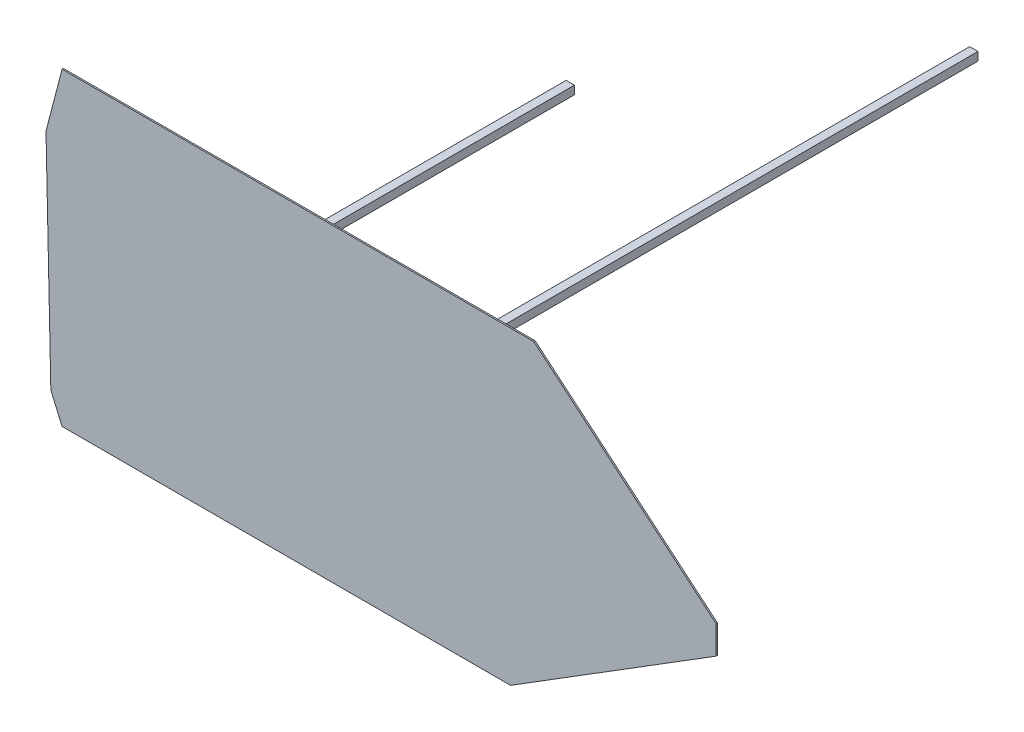
ISO-10303-21;
HEADER;
FILE_DESCRIPTION(('STEP AP214'),'2;1');
FILE_NAME('part.step','',(''),(''),'','','');
FILE_SCHEMA(('AUTOMOTIVE_DESIGN { 1 0 10303 214 1 1 1 1 }'));
ENDSEC;
DATA;
#1=APPLICATION_CONTEXT('core data for automotive mechanical design processes');
#2=APPLICATION_PROTOCOL_DEFINITION('international standard','automotive_design',2000,#1);
#3=PRODUCT_CONTEXT('',#1,'mechanical');
#4=PRODUCT('Part','Part','',(#3));
#5=PRODUCT_RELATED_PRODUCT_CATEGORY('part','',(#4));
#6=PRODUCT_DEFINITION_FORMATION('','',#4);
#7=PRODUCT_DEFINITION_CONTEXT('part definition',#1,'design');
#8=PRODUCT_DEFINITION('design','',#6,#7);
#9=PRODUCT_DEFINITION_SHAPE('','',#8);
#10=(LENGTH_UNIT() NAMED_UNIT(*) SI_UNIT(.MILLI.,.METRE.));
#11=(NAMED_UNIT(*) PLANE_ANGLE_UNIT() SI_UNIT($,.RADIAN.));
#12=(NAMED_UNIT(*) SI_UNIT($,.STERADIAN.) SOLID_ANGLE_UNIT());
#13=UNCERTAINTY_MEASURE_WITH_UNIT(LENGTH_MEASURE(1.E-05),#10,'distance_accuracy_value','');
#14=(GEOMETRIC_REPRESENTATION_CONTEXT(3) GLOBAL_UNCERTAINTY_ASSIGNED_CONTEXT((#13)) GLOBAL_UNIT_ASSIGNED_CONTEXT((#10,
#11,#12)) REPRESENTATION_CONTEXT('',''));
#15=CARTESIAN_POINT('',(0.,0.,0.));
#16=DIRECTION('',(0.,0.,1.));
#17=DIRECTION('',(1.,0.,0.));
#18=AXIS2_PLACEMENT_3D('',#15,#16,#17);
#19=CARTESIAN_POINT('',(284.,44.2389394642747,-350.));
#20=DIRECTION('',(1.,0.,0.));
#21=DIRECTION('',(0.,0.,-1.));
#22=AXIS2_PLACEMENT_3D('',#19,#20,#21);
#23=PLANE('',#22);
#24=DIRECTION('',(0.,1.,0.));
#25=VECTOR('',#24,1.);
#26=CARTESIAN_POINT('',(284.,44.2389394642747,0.));
#27=LINE('',#26,#25);
#28=CARTESIAN_POINT('',(284.,44.2389394642747,0.));
#29=VERTEX_POINT('',#28);
#30=CARTESIAN_POINT('',(284.,50.2389394642747,0.));
#31=VERTEX_POINT('',#30);
#32=EDGE_CURVE('E108',#29,#31,#27,.T.);
#33=ORIENTED_EDGE('',*,*,#32,.T.);
#34=DIRECTION('',(0.,0.,1.));
#35=VECTOR('',#34,1.);
#36=CARTESIAN_POINT('',(284.,50.2389394642747,-350.));
#37=LINE('',#36,#35);
#38=CARTESIAN_POINT('',(284.,50.2389394642747,-350.));
#39=VERTEX_POINT('',#38);
#40=EDGE_CURVE('E12',#39,#31,#37,.T.);
#41=ORIENTED_EDGE('',*,*,#40,.F.);
#42=DIRECTION('',(0.,1.,0.));
#43=VECTOR('',#42,1.);
#44=CARTESIAN_POINT('',(284.,44.2389394642747,-350.));
#45=LINE('',#44,#43);
#46=CARTESIAN_POINT('',(284.,44.2389394642747,-350.));
#47=VERTEX_POINT('',#46);
#48=EDGE_CURVE('E96',#47,#39,#45,.T.);
#49=ORIENTED_EDGE('',*,*,#48,.F.);
#50=DIRECTION('',(0.,0.,1.));
#51=VECTOR('',#50,1.);
#52=CARTESIAN_POINT('',(284.,44.2389394642747,-350.));
#53=LINE('',#52,#51);
#54=EDGE_CURVE('E104',#47,#29,#53,.T.);
#55=ORIENTED_EDGE('',*,*,#54,.T.);
#56=EDGE_LOOP('',(#33,#41,#49,#55));
#57=FACE_BOUND('',#56,.T.);
#58=ADVANCED_FACE('F45',(#57),#23,.F.);
#59=CARTESIAN_POINT('',(284.,50.2389394642747,-350.));
#60=DIRECTION('',(0.,-1.,0.));
#61=DIRECTION('',(0.,0.,-1.));
#62=AXIS2_PLACEMENT_3D('',#59,#60,#61);
#63=PLANE('',#62);
#64=DIRECTION('',(1.,0.,0.));
#65=VECTOR('',#64,1.);
#66=CARTESIAN_POINT('',(284.,50.2389394642747,0.));
#67=LINE('',#66,#65);
#68=CARTESIAN_POINT('',(290.,50.2389394642747,0.));
#69=VERTEX_POINT('',#68);
#70=EDGE_CURVE('E100',#31,#69,#67,.T.);
#71=ORIENTED_EDGE('',*,*,#70,.T.);
#72=DIRECTION('',(0.,0.,1.));
#73=VECTOR('',#72,1.);
#74=CARTESIAN_POINT('',(290.,50.2389394642747,-350.));
#75=LINE('',#74,#73);
#76=CARTESIAN_POINT('',(290.,50.2389394642747,-350.));
#77=VERTEX_POINT('',#76);
#78=EDGE_CURVE('E53',#77,#69,#75,.T.);
#79=ORIENTED_EDGE('',*,*,#78,.F.);
#80=DIRECTION('',(1.,0.,0.));
#81=VECTOR('',#80,1.);
#82=CARTESIAN_POINT('',(284.,50.2389394642747,-350.));
#83=LINE('',#82,#81);
#84=EDGE_CURVE('E91',#39,#77,#83,.T.);
#85=ORIENTED_EDGE('',*,*,#84,.F.);
#86=ORIENTED_EDGE('',*,*,#40,.T.);
#87=EDGE_LOOP('',(#71,#79,#85,#86));
#88=FACE_BOUND('',#87,.T.);
#89=ADVANCED_FACE('F99',(#88),#63,.F.);
#90=CARTESIAN_POINT('',(290.,44.2389394642747,-350.));
#91=DIRECTION('',(-1.,0.,0.));
#92=DIRECTION('',(0.,0.,1.));
#93=AXIS2_PLACEMENT_3D('',#90,#91,#92);
#94=PLANE('',#93);
#95=DIRECTION('',(0.,-1.,0.));
#96=VECTOR('',#95,1.);
#97=CARTESIAN_POINT('',(290.,44.2389394642747,0.));
#98=LINE('',#97,#96);
#99=CARTESIAN_POINT('',(290.,44.2389394642747,0.));
#100=VERTEX_POINT('',#99);
#101=EDGE_CURVE('E78',#69,#100,#98,.T.);
#102=ORIENTED_EDGE('',*,*,#101,.T.);
#103=DIRECTION('',(0.,0.,1.));
#104=VECTOR('',#103,1.);
#105=CARTESIAN_POINT('',(290.,44.2389394642747,-350.));
#106=LINE('',#105,#104);
#107=CARTESIAN_POINT('',(290.,44.2389394642747,-350.));
#108=VERTEX_POINT('',#107);
#109=EDGE_CURVE('E101',#108,#100,#106,.T.);
#110=ORIENTED_EDGE('',*,*,#109,.F.);
#111=DIRECTION('',(0.,-1.,0.));
#112=VECTOR('',#111,1.);
#113=CARTESIAN_POINT('',(290.,44.2389394642747,-350.));
#114=LINE('',#113,#112);
#115=EDGE_CURVE('E94',#77,#108,#114,.T.);
#116=ORIENTED_EDGE('',*,*,#115,.F.);
#117=ORIENTED_EDGE('',*,*,#78,.T.);
#118=EDGE_LOOP('',(#102,#110,#116,#117));
#119=FACE_BOUND('',#118,.T.);
#120=ADVANCED_FACE('F102',(#119),#94,.F.);
#121=CARTESIAN_POINT('',(284.,44.2389394642747,-350.));
#122=DIRECTION('',(0.,1.,0.));
#123=DIRECTION('',(0.,0.,1.));
#124=AXIS2_PLACEMENT_3D('',#121,#122,#123);
#125=PLANE('',#124);
#126=DIRECTION('',(-1.,0.,0.));
#127=VECTOR('',#126,1.);
#128=CARTESIAN_POINT('',(284.,44.2389394642747,0.));
#129=LINE('',#128,#127);
#130=EDGE_CURVE('E84',#100,#29,#129,.T.);
#131=ORIENTED_EDGE('',*,*,#130,.T.);
#132=ORIENTED_EDGE('',*,*,#54,.F.);
#133=DIRECTION('',(-1.,0.,0.));
#134=VECTOR('',#133,1.);
#135=CARTESIAN_POINT('',(284.,44.2389394642747,-350.));
#136=LINE('',#135,#134);
#137=EDGE_CURVE('E61',#108,#47,#136,.T.);
#138=ORIENTED_EDGE('',*,*,#137,.F.);
#139=ORIENTED_EDGE('',*,*,#109,.T.);
#140=EDGE_LOOP('',(#131,#132,#138,#139));
#141=FACE_BOUND('',#140,.T.);
#142=ADVANCED_FACE('F115',(#141),#125,.F.);
#143=CARTESIAN_POINT('',(0.,0.,-350.));
#144=DIRECTION('',(0.,0.,-1.));
#145=DIRECTION('',(-1.,0.,0.));
#146=AXIS2_PLACEMENT_3D('',#143,#144,#145);
#147=PLANE('',#146);
#148=ORIENTED_EDGE('',*,*,#48,.T.);
#149=ORIENTED_EDGE('',*,*,#84,.T.);
#150=ORIENTED_EDGE('',*,*,#115,.T.);
#151=ORIENTED_EDGE('',*,*,#137,.T.);
#152=EDGE_LOOP('',(#148,#149,#150,#151));
#153=FACE_BOUND('',#152,.T.);
#154=ADVANCED_FACE('F92',(#153),#147,.T.);
#155=CARTESIAN_POINT('',(0.,0.,0.));
#156=DIRECTION('',(0.,0.,-1.));
#157=DIRECTION('',(-1.,0.,0.));
#158=AXIS2_PLACEMENT_3D('',#155,#156,#157);
#159=PLANE('',#158);
#160=ORIENTED_EDGE('',*,*,#32,.F.);
#161=ORIENTED_EDGE('',*,*,#130,.F.);
#162=ORIENTED_EDGE('',*,*,#101,.F.);
#163=ORIENTED_EDGE('',*,*,#70,.F.);
#164=EDGE_LOOP('',(#160,#161,#162,#163));
#165=FACE_BOUND('',#164,.T.);
#166=ADVANCED_FACE('F118',(#165),#159,.F.);
#167=CLOSED_SHELL('',(#58,#89,#120,#142,#154,#166));
#168=MANIFOLD_SOLID_BREP('B2',#167);
#169=CARTESIAN_POINT('',(0.,-115.721693300611,-350.));
#170=DIRECTION('',(-1.,0.,0.));
#171=DIRECTION('',(0.,0.,1.));
#172=AXIS2_PLACEMENT_3D('',#169,#170,#171);
#173=PLANE('',#172);
#174=DIRECTION('',(0.,-1.,0.));
#175=VECTOR('',#174,1.);
#176=CARTESIAN_POINT('',(0.,-115.721693300611,0.));
#177=LINE('',#176,#175);
#178=CARTESIAN_POINT('',(0.,-115.721693300611,0.));
#179=VERTEX_POINT('',#178);
#180=CARTESIAN_POINT('',(0.,-121.721693300611,0.));
#181=VERTEX_POINT('',#180);
#182=EDGE_CURVE('E240',#179,#181,#177,.T.);
#183=ORIENTED_EDGE('',*,*,#182,.T.);
#184=DIRECTION('',(0.,0.,1.));
#185=VECTOR('',#184,1.);
#186=CARTESIAN_POINT('',(0.,-121.721693300611,-350.));
#187=LINE('',#186,#185);
#188=CARTESIAN_POINT('',(0.,-121.721693300611,-350.));
#189=VERTEX_POINT('',#188);
#190=EDGE_CURVE('E43',#189,#181,#187,.T.);
#191=ORIENTED_EDGE('',*,*,#190,.F.);
#192=DIRECTION('',(0.,-1.,0.));
#193=VECTOR('',#192,1.);
#194=CARTESIAN_POINT('',(0.,-115.721693300611,-350.));
#195=LINE('',#194,#193);
#196=CARTESIAN_POINT('',(0.,-115.721693300611,-350.));
#197=VERTEX_POINT('',#196);
#198=EDGE_CURVE('E228',#197,#189,#195,.T.);
#199=ORIENTED_EDGE('',*,*,#198,.F.);
#200=DIRECTION('',(0.,0.,1.));
#201=VECTOR('',#200,1.);
#202=CARTESIAN_POINT('',(0.,-115.721693300611,-350.));
#203=LINE('',#202,#201);
#204=EDGE_CURVE('E236',#197,#179,#203,.T.);
#205=ORIENTED_EDGE('',*,*,#204,.T.);
#206=EDGE_LOOP('',(#183,#191,#199,#205));
#207=FACE_BOUND('',#206,.T.);
#208=ADVANCED_FACE('F177',(#207),#173,.F.);
#209=CARTESIAN_POINT('',(0.,-121.721693300611,-350.));
#210=DIRECTION('',(0.,1.,0.));
#211=DIRECTION('',(0.,0.,1.));
#212=AXIS2_PLACEMENT_3D('',#209,#210,#211);
#213=PLANE('',#212);
#214=DIRECTION('',(-1.,0.,0.));
#215=VECTOR('',#214,1.);
#216=CARTESIAN_POINT('',(0.,-121.721693300611,0.));
#217=LINE('',#216,#215);
#218=CARTESIAN_POINT('',(-6.,-121.721693300611,0.));
#219=VERTEX_POINT('',#218);
#220=EDGE_CURVE('E232',#181,#219,#217,.T.);
#221=ORIENTED_EDGE('',*,*,#220,.T.);
#222=DIRECTION('',(0.,0.,1.));
#223=VECTOR('',#222,1.);
#224=CARTESIAN_POINT('',(-6.,-121.721693300611,-350.));
#225=LINE('',#224,#223);
#226=CARTESIAN_POINT('',(-6.,-121.721693300611,-350.));
#227=VERTEX_POINT('',#226);
#228=EDGE_CURVE('E185',#227,#219,#225,.T.);
#229=ORIENTED_EDGE('',*,*,#228,.F.);
#230=DIRECTION('',(-1.,0.,0.));
#231=VECTOR('',#230,1.);
#232=CARTESIAN_POINT('',(0.,-121.721693300611,-350.));
#233=LINE('',#232,#231);
#234=EDGE_CURVE('E223',#189,#227,#233,.T.);
#235=ORIENTED_EDGE('',*,*,#234,.F.);
#236=ORIENTED_EDGE('',*,*,#190,.T.);
#237=EDGE_LOOP('',(#221,#229,#235,#236));
#238=FACE_BOUND('',#237,.T.);
#239=ADVANCED_FACE('F231',(#238),#213,.F.);
#240=CARTESIAN_POINT('',(-6.,-121.721693300611,-350.));
#241=DIRECTION('',(1.,0.,0.));
#242=DIRECTION('',(0.,0.,-1.));
#243=AXIS2_PLACEMENT_3D('',#240,#241,#242);
#244=PLANE('',#243);
#245=DIRECTION('',(0.,1.,0.));
#246=VECTOR('',#245,1.);
#247=CARTESIAN_POINT('',(-6.,-121.721693300611,0.));
#248=LINE('',#247,#246);
#249=CARTESIAN_POINT('',(-6.,-115.721693300611,0.));
#250=VERTEX_POINT('',#249);
#251=EDGE_CURVE('E210',#219,#250,#248,.T.);
#252=ORIENTED_EDGE('',*,*,#251,.T.);
#253=DIRECTION('',(0.,0.,1.));
#254=VECTOR('',#253,1.);
#255=CARTESIAN_POINT('',(-6.,-115.721693300611,-350.));
#256=LINE('',#255,#254);
#257=CARTESIAN_POINT('',(-6.,-115.721693300611,-350.));
#258=VERTEX_POINT('',#257);
#259=EDGE_CURVE('E233',#258,#250,#256,.T.);
#260=ORIENTED_EDGE('',*,*,#259,.F.);
#261=DIRECTION('',(0.,1.,0.));
#262=VECTOR('',#261,1.);
#263=CARTESIAN_POINT('',(-6.,-121.721693300611,-350.));
#264=LINE('',#263,#262);
#265=EDGE_CURVE('E226',#227,#258,#264,.T.);
#266=ORIENTED_EDGE('',*,*,#265,.F.);
#267=ORIENTED_EDGE('',*,*,#228,.T.);
#268=EDGE_LOOP('',(#252,#260,#266,#267));
#269=FACE_BOUND('',#268,.T.);
#270=ADVANCED_FACE('F234',(#269),#244,.F.);
#271=CARTESIAN_POINT('',(-6.,-115.721693300611,-350.));
#272=DIRECTION('',(0.,-1.,0.));
#273=DIRECTION('',(0.,0.,-1.));
#274=AXIS2_PLACEMENT_3D('',#271,#272,#273);
#275=PLANE('',#274);
#276=DIRECTION('',(1.,0.,0.));
#277=VECTOR('',#276,1.);
#278=CARTESIAN_POINT('',(-6.,-115.721693300611,0.));
#279=LINE('',#278,#277);
#280=EDGE_CURVE('E216',#250,#179,#279,.T.);
#281=ORIENTED_EDGE('',*,*,#280,.T.);
#282=ORIENTED_EDGE('',*,*,#204,.F.);
#283=DIRECTION('',(1.,0.,0.));
#284=VECTOR('',#283,1.);
#285=CARTESIAN_POINT('',(-6.,-115.721693300611,-350.));
#286=LINE('',#285,#284);
#287=EDGE_CURVE('E193',#258,#197,#286,.T.);
#288=ORIENTED_EDGE('',*,*,#287,.F.);
#289=ORIENTED_EDGE('',*,*,#259,.T.);
#290=EDGE_LOOP('',(#281,#282,#288,#289));
#291=FACE_BOUND('',#290,.T.);
#292=ADVANCED_FACE('F247',(#291),#275,.F.);
#293=CARTESIAN_POINT('',(0.,0.,-350.));
#294=DIRECTION('',(0.,0.,-1.));
#295=DIRECTION('',(-1.,0.,0.));
#296=AXIS2_PLACEMENT_3D('',#293,#294,#295);
#297=PLANE('',#296);
#298=ORIENTED_EDGE('',*,*,#198,.T.);
#299=ORIENTED_EDGE('',*,*,#234,.T.);
#300=ORIENTED_EDGE('',*,*,#265,.T.);
#301=ORIENTED_EDGE('',*,*,#287,.T.);
#302=EDGE_LOOP('',(#298,#299,#300,#301));
#303=FACE_BOUND('',#302,.T.);
#304=ADVANCED_FACE('F224',(#303),#297,.T.);
#305=CARTESIAN_POINT('',(0.,0.,0.));
#306=DIRECTION('',(0.,0.,-1.));
#307=DIRECTION('',(-1.,0.,0.));
#308=AXIS2_PLACEMENT_3D('',#305,#306,#307);
#309=PLANE('',#308);
#310=ORIENTED_EDGE('',*,*,#182,.F.);
#311=ORIENTED_EDGE('',*,*,#280,.F.);
#312=ORIENTED_EDGE('',*,*,#251,.F.);
#313=ORIENTED_EDGE('',*,*,#220,.F.);
#314=EDGE_LOOP('',(#310,#311,#312,#313));
#315=FACE_BOUND('',#314,.T.);
#316=ADVANCED_FACE('F250',(#315),#309,.F.);
#317=CLOSED_SHELL('',(#208,#239,#270,#292,#304,#316));
#318=MANIFOLD_SOLID_BREP('B6',#317);
#319=CARTESIAN_POINT('',(0.,0.,5.));
#320=DIRECTION('',(1.,0.,0.));
#321=DIRECTION('',(0.,0.,-1.));
#322=AXIS2_PLACEMENT_3D('',#319,#320,#321);
#323=PLANE('',#322);
#324=DIRECTION('',(0.,-1.,0.));
#325=VECTOR('',#324,1.);
#326=CARTESIAN_POINT('',(0.,0.,0.));
#327=LINE('',#326,#325);
#328=CARTESIAN_POINT('',(0.,50.,0.));
#329=VERTEX_POINT('',#328);
#330=CARTESIAN_POINT('',(0.,13.2972351092578,0.));
#331=VERTEX_POINT('',#330);
#332=EDGE_CURVE('E344',#329,#331,#327,.T.);
#333=ORIENTED_EDGE('',*,*,#332,.T.);
#334=DIRECTION('',(0.,0.,1.));
#335=VECTOR('',#334,1.);
#336=CARTESIAN_POINT('',(0.,13.2972351092578,5.));
#337=LINE('',#336,#335);
#338=CARTESIAN_POINT('',(0.,13.2972351092578,5.));
#339=VERTEX_POINT('',#338);
#340=EDGE_CURVE('E353',#331,#339,#337,.T.);
#341=ORIENTED_EDGE('',*,*,#340,.T.);
#342=DIRECTION('',(0.,-1.,0.));
#343=VECTOR('',#342,1.);
#344=CARTESIAN_POINT('',(0.,0.,5.));
#345=LINE('',#344,#343);
#346=CARTESIAN_POINT('',(0.,50.,5.));
#347=VERTEX_POINT('',#346);
#348=EDGE_CURVE('E338',#347,#339,#345,.T.);
#349=ORIENTED_EDGE('',*,*,#348,.F.);
#350=DIRECTION('',(0.,0.,-1.));
#351=VECTOR('',#350,1.);
#352=CARTESIAN_POINT('',(0.,50.,5.));
#353=LINE('',#352,#351);
#354=EDGE_CURVE('E307',#347,#329,#353,.T.);
#355=ORIENTED_EDGE('',*,*,#354,.T.);
#356=EDGE_LOOP('',(#333,#341,#349,#355));
#357=FACE_BOUND('',#356,.T.);
#358=ADVANCED_FACE('F300',(#357),#323,.F.);
#359=CARTESIAN_POINT('',(50.,0.,5.));
#360=DIRECTION('',(-1.,0.,0.));
#361=DIRECTION('',(0.,0.,1.));
#362=AXIS2_PLACEMENT_3D('',#359,#360,#361);
#363=PLANE('',#362);
#364=DIRECTION('',(0.,1.,0.));
#365=VECTOR('',#364,1.);
#366=CARTESIAN_POINT('',(50.,0.,5.));
#367=LINE('',#366,#365);
#368=CARTESIAN_POINT('',(50.,48.3554387805851,5.));
#369=VERTEX_POINT('',#368);
#370=CARTESIAN_POINT('',(50.,50.,5.));
#371=VERTEX_POINT('',#370);
#372=EDGE_CURVE('E359',#369,#371,#367,.T.);
#373=ORIENTED_EDGE('',*,*,#372,.F.);
#374=DIRECTION('',(0.,0.,-1.));
#375=VECTOR('',#374,1.);
#376=CARTESIAN_POINT('',(50.,48.3554387805851,5.));
#377=LINE('',#376,#375);
#378=CARTESIAN_POINT('',(50.,48.3554387805851,0.));
#379=VERTEX_POINT('',#378);
#380=EDGE_CURVE('E314',#369,#379,#377,.T.);
#381=ORIENTED_EDGE('',*,*,#380,.T.);
#382=DIRECTION('',(0.,1.,0.));
#383=VECTOR('',#382,1.);
#384=CARTESIAN_POINT('',(50.,0.,0.));
#385=LINE('',#384,#383);
#386=CARTESIAN_POINT('',(50.,50.,0.));
#387=VERTEX_POINT('',#386);
#388=EDGE_CURVE('E339',#379,#387,#385,.T.);
#389=ORIENTED_EDGE('',*,*,#388,.T.);
#390=DIRECTION('',(0.,0.,-1.));
#391=VECTOR('',#390,1.);
#392=CARTESIAN_POINT('',(50.,50.,5.));
#393=LINE('',#392,#391);
#394=EDGE_CURVE('E175',#371,#387,#393,.T.);
#395=ORIENTED_EDGE('',*,*,#394,.F.);
#396=EDGE_LOOP('',(#373,#381,#389,#395));
#397=FACE_BOUND('',#396,.T.);
#398=ADVANCED_FACE('F598',(#397),#363,.F.);
#399=CARTESIAN_POINT('',(0.,50.,5.));
#400=DIRECTION('',(0.,-1.,0.));
#401=DIRECTION('',(0.,0.,-1.));
#402=AXIS2_PLACEMENT_3D('',#399,#400,#401);
#403=PLANE('',#402);
#404=DIRECTION('',(-1.,0.,0.));
#405=VECTOR('',#404,1.);
#406=CARTESIAN_POINT('',(0.,50.,0.));
#407=LINE('',#406,#405);
#408=EDGE_CURVE('E333',#387,#329,#407,.T.);
#409=ORIENTED_EDGE('',*,*,#408,.T.);
#410=ORIENTED_EDGE('',*,*,#354,.F.);
#411=DIRECTION('',(-1.,0.,0.));
#412=VECTOR('',#411,1.);
#413=CARTESIAN_POINT('',(0.,50.,5.));
#414=LINE('',#413,#412);
#415=EDGE_CURVE('E347',#371,#347,#414,.T.);
#416=ORIENTED_EDGE('',*,*,#415,.F.);
#417=ORIENTED_EDGE('',*,*,#394,.T.);
#418=EDGE_LOOP('',(#409,#410,#416,#417));
#419=FACE_BOUND('',#418,.T.);
#420=ADVANCED_FACE('F334',(#419),#403,.F.);
#421=CARTESIAN_POINT('',(0.,0.,0.));
#422=DIRECTION('',(0.,0.,-1.));
#423=DIRECTION('',(-1.,0.,0.));
#424=AXIS2_PLACEMENT_3D('',#421,#422,#423);
#425=PLANE('',#424);
#426=ORIENTED_EDGE('',*,*,#388,.F.);
#427=DIRECTION('',(-0.818783894132803,-0.574101850466207,0.));
#428=VECTOR('',#427,1.);
#429=CARTESIAN_POINT('',(-5.65345301651853,9.33323696327008,0.));
#430=LINE('',#429,#428);
#431=CARTESIAN_POINT('',(57.2851954893892,53.463556125634,0.));
#432=VERTEX_POINT('',#431);
#433=EDGE_CURVE('E369',#432,#379,#430,.T.);
#434=ORIENTED_EDGE('',*,*,#433,.F.);
#435=DIRECTION('',(-1.,0.,0.));
#436=VECTOR('',#435,1.);
#437=CARTESIAN_POINT('',(57.2851954893892,53.463556125634,0.));
#438=LINE('',#437,#436);
#439=CARTESIAN_POINT('',(231.691551155374,53.463556125634,0.));
#440=VERTEX_POINT('',#439);
#441=EDGE_CURVE('E417',#440,#432,#438,.T.);
#442=ORIENTED_EDGE('',*,*,#441,.F.);
#443=DIRECTION('',(-0.692456357581788,0.721459765229193,0.));
#444=VECTOR('',#443,1.);
#445=CARTESIAN_POINT('',(231.691551155374,53.463556125634,0.));
#446=LINE('',#445,#444);
#447=CARTESIAN_POINT('',(285.935787310265,-3.05268992056147,0.));
#448=VERTEX_POINT('',#447);
#449=EDGE_CURVE('E420',#448,#440,#446,.T.);
#450=ORIENTED_EDGE('',*,*,#449,.F.);
#451=DIRECTION('',(0.0243555051501465,0.999703360687,0.));
#452=VECTOR('',#451,1.);
#453=CARTESIAN_POINT('',(285.935787310265,-3.05268992056147,0.));
#454=LINE('',#453,#452);
#455=CARTESIAN_POINT('',(284.,-82.5095957706715,0.));
#456=VERTEX_POINT('',#455);
#457=EDGE_CURVE('E423',#456,#448,#454,.T.);
#458=ORIENTED_EDGE('',*,*,#457,.F.);
#459=DIRECTION('',(0.850155575938282,0.526531572368693,0.));
#460=VECTOR('',#459,1.);
#461=CARTESIAN_POINT('',(284.,-82.5095957706715,0.));
#462=LINE('',#461,#460);
#463=CARTESIAN_POINT('',(207.706196647344,-129.761060535725,0.));
#464=VERTEX_POINT('',#463);
#465=EDGE_CURVE('E426',#464,#456,#462,.T.);
#466=ORIENTED_EDGE('',*,*,#465,.F.);
#467=DIRECTION('',(1.,0.,0.));
#468=VECTOR('',#467,1.);
#469=CARTESIAN_POINT('',(207.706196647344,-129.761060535725,0.));
#470=LINE('',#469,#468);
#471=CARTESIAN_POINT('',(50.4315162126425,-129.761060535725,0.));
#472=VERTEX_POINT('',#471);
#473=EDGE_CURVE('E429',#472,#464,#470,.T.);
#474=ORIENTED_EDGE('',*,*,#473,.F.);
#475=DIRECTION('',(0.784223478805287,-0.620478472866331,0.));
#476=VECTOR('',#475,1.);
#477=CARTESIAN_POINT('',(50.4315162126425,-129.761060535725,0.));
#478=LINE('',#477,#476);
#479=CARTESIAN_POINT('',(-5.65345301651853,-85.386571632282,0.));
#480=VERTEX_POINT('',#479);
#481=EDGE_CURVE('E432',#480,#472,#478,.T.);
#482=ORIENTED_EDGE('',*,*,#481,.F.);
#483=DIRECTION('',(0.,-1.,0.));
#484=VECTOR('',#483,1.);
#485=CARTESIAN_POINT('',(-5.65345301651853,-85.386571632282,0.));
#486=LINE('',#485,#484);
#487=CARTESIAN_POINT('',(-5.65345301651853,9.33323696327008,0.));
#488=VERTEX_POINT('',#487);
#489=EDGE_CURVE('E392',#488,#480,#486,.T.);
#490=ORIENTED_EDGE('',*,*,#489,.F.);
#491=EDGE_CURVE('E352',#331,#488,#430,.T.);
#492=ORIENTED_EDGE('',*,*,#491,.F.);
#493=ORIENTED_EDGE('',*,*,#332,.F.);
#494=ORIENTED_EDGE('',*,*,#408,.F.);
#495=EDGE_LOOP('',(#426,#434,#442,#450,#458,#466,#474,#482,#490,#492,#493,#494));
#496=FACE_BOUND('',#495,.T.);
#497=ADVANCED_FACE('F349',(#496),#425,.T.);
#498=CARTESIAN_POINT('',(-5.65345301651853,9.33323696327008,0.));
#499=DIRECTION('',(-0.574101850466207,0.818783894132803,0.));
#500=DIRECTION('',(-0.818783894132803,-0.574101850466207,0.));
#501=AXIS2_PLACEMENT_3D('',#498,#499,#500);
#502=PLANE('',#501);
#503=ORIENTED_EDGE('',*,*,#340,.F.);
#504=ORIENTED_EDGE('',*,*,#491,.T.);
#505=DIRECTION('',(0.,0.,1.));
#506=VECTOR('',#505,1.);
#507=CARTESIAN_POINT('',(-5.65345301651853,9.33323696327008,0.));
#508=LINE('',#507,#506);
#509=CARTESIAN_POINT('',(-5.65345301651853,9.33323696327008,5.));
#510=VERTEX_POINT('',#509);
#511=EDGE_CURVE('E364',#488,#510,#508,.T.);
#512=ORIENTED_EDGE('',*,*,#511,.T.);
#513=DIRECTION('',(-0.818783894132803,-0.574101850466207,0.));
#514=VECTOR('',#513,1.);
#515=CARTESIAN_POINT('',(-5.65345301651853,9.33323696327008,5.));
#516=LINE('',#515,#514);
#517=EDGE_CURVE('E393',#339,#510,#516,.T.);
#518=ORIENTED_EDGE('',*,*,#517,.F.);
#519=EDGE_LOOP('',(#503,#504,#512,#518));
#520=FACE_BOUND('',#519,.T.);
#521=ADVANCED_FACE('F592',(#520),#502,.T.);
#522=ORIENTED_EDGE('',*,*,#380,.F.);
#523=CARTESIAN_POINT('',(57.2851954893892,53.463556125634,5.));
#524=VERTEX_POINT('',#523);
#525=EDGE_CURVE('E389',#524,#369,#516,.T.);
#526=ORIENTED_EDGE('',*,*,#525,.F.);
#527=DIRECTION('',(0.,0.,1.));
#528=VECTOR('',#527,1.);
#529=CARTESIAN_POINT('',(57.2851954893892,53.463556125634,0.));
#530=LINE('',#529,#528);
#531=EDGE_CURVE('E384',#432,#524,#530,.T.);
#532=ORIENTED_EDGE('',*,*,#531,.F.);
#533=ORIENTED_EDGE('',*,*,#433,.T.);
#534=EDGE_LOOP('',(#522,#526,#532,#533));
#535=FACE_BOUND('',#534,.T.);
#536=ADVANCED_FACE('F602',(#535),#502,.T.);
#537=CARTESIAN_POINT('',(-5.65345301651853,-85.386571632282,0.));
#538=DIRECTION('',(-1.,0.,0.));
#539=DIRECTION('',(0.,0.,1.));
#540=AXIS2_PLACEMENT_3D('',#537,#538,#539);
#541=PLANE('',#540);
#542=DIRECTION('',(0.,-1.,0.));
#543=VECTOR('',#542,1.);
#544=CARTESIAN_POINT('',(-5.65345301651853,-85.386571632282,5.));
#545=LINE('',#544,#543);
#546=CARTESIAN_POINT('',(-5.65345301651853,-85.386571632282,5.));
#547=VERTEX_POINT('',#546);
#548=EDGE_CURVE('E412',#510,#547,#545,.T.);
#549=ORIENTED_EDGE('',*,*,#548,.F.);
#550=ORIENTED_EDGE('',*,*,#511,.F.);
#551=ORIENTED_EDGE('',*,*,#489,.T.);
#552=DIRECTION('',(0.,0.,1.));
#553=VECTOR('',#552,1.);
#554=CARTESIAN_POINT('',(-5.65345301651853,-85.386571632282,0.));
#555=LINE('',#554,#553);
#556=EDGE_CURVE('E365',#480,#547,#555,.T.);
#557=ORIENTED_EDGE('',*,*,#556,.T.);
#558=EDGE_LOOP('',(#549,#550,#551,#557));
#559=FACE_BOUND('',#558,.T.);
#560=ADVANCED_FACE('F626',(#559),#541,.T.);
#561=CARTESIAN_POINT('',(57.2851954893892,53.463556125634,0.));
#562=DIRECTION('',(0.,1.,0.));
#563=DIRECTION('',(0.,0.,1.));
#564=AXIS2_PLACEMENT_3D('',#561,#562,#563);
#565=PLANE('',#564);
#566=DIRECTION('',(-1.,0.,0.));
#567=VECTOR('',#566,1.);
#568=CARTESIAN_POINT('',(57.2851954893892,53.463556125634,5.));
#569=LINE('',#568,#567);
#570=CARTESIAN_POINT('',(231.691551155374,53.463556125634,5.));
#571=VERTEX_POINT('',#570);
#572=EDGE_CURVE('E394',#571,#524,#569,.T.);
#573=ORIENTED_EDGE('',*,*,#572,.F.);
#574=DIRECTION('',(0.,0.,1.));
#575=VECTOR('',#574,1.);
#576=CARTESIAN_POINT('',(231.691551155374,53.463556125634,0.));
#577=LINE('',#576,#575);
#578=EDGE_CURVE('E381',#440,#571,#577,.T.);
#579=ORIENTED_EDGE('',*,*,#578,.F.);
#580=ORIENTED_EDGE('',*,*,#441,.T.);
#581=ORIENTED_EDGE('',*,*,#531,.T.);
#582=EDGE_LOOP('',(#573,#579,#580,#581));
#583=FACE_BOUND('',#582,.T.);
#584=ADVANCED_FACE('F605',(#583),#565,.T.);
#585=CARTESIAN_POINT('',(231.691551155374,53.463556125634,0.));
#586=DIRECTION('',(0.721459765229193,0.692456357581788,0.));
#587=DIRECTION('',(-0.692456357581788,0.721459765229193,0.));
#588=AXIS2_PLACEMENT_3D('',#585,#586,#587);
#589=PLANE('',#588);
#590=DIRECTION('',(-0.692456357581788,0.721459765229193,0.));
#591=VECTOR('',#590,1.);
#592=CARTESIAN_POINT('',(231.691551155374,53.463556125634,5.));
#593=LINE('',#592,#591);
#594=CARTESIAN_POINT('',(285.935787310265,-3.05268992056147,5.));
#595=VERTEX_POINT('',#594);
#596=EDGE_CURVE('E397',#595,#571,#593,.T.);
#597=ORIENTED_EDGE('',*,*,#596,.F.);
#598=DIRECTION('',(0.,0.,1.));
#599=VECTOR('',#598,1.);
#600=CARTESIAN_POINT('',(285.935787310265,-3.05268992056147,0.));
#601=LINE('',#600,#599);
#602=EDGE_CURVE('E378',#448,#595,#601,.T.);
#603=ORIENTED_EDGE('',*,*,#602,.F.);
#604=ORIENTED_EDGE('',*,*,#449,.T.);
#605=ORIENTED_EDGE('',*,*,#578,.T.);
#606=EDGE_LOOP('',(#597,#603,#604,#605));
#607=FACE_BOUND('',#606,.T.);
#608=ADVANCED_FACE('F608',(#607),#589,.T.);
#609=CARTESIAN_POINT('',(285.935787310265,-3.05268992056147,0.));
#610=DIRECTION('',(0.999703360687,-0.0243555051501465,0.));
#611=DIRECTION('',(0.0243555051501465,0.999703360687,0.));
#612=AXIS2_PLACEMENT_3D('',#609,#610,#611);
#613=PLANE('',#612);
#614=DIRECTION('',(0.0243555051501465,0.999703360687,0.));
#615=VECTOR('',#614,1.);
#616=CARTESIAN_POINT('',(285.935787310265,-3.05268992056147,5.));
#617=LINE('',#616,#615);
#618=CARTESIAN_POINT('',(284.,-82.5095957706715,5.));
#619=VERTEX_POINT('',#618);
#620=EDGE_CURVE('E400',#619,#595,#617,.T.);
#621=ORIENTED_EDGE('',*,*,#620,.F.);
#622=DIRECTION('',(0.,0.,1.));
#623=VECTOR('',#622,1.);
#624=CARTESIAN_POINT('',(284.,-82.5095957706715,0.));
#625=LINE('',#624,#623);
#626=EDGE_CURVE('E375',#456,#619,#625,.T.);
#627=ORIENTED_EDGE('',*,*,#626,.F.);
#628=ORIENTED_EDGE('',*,*,#457,.T.);
#629=ORIENTED_EDGE('',*,*,#602,.T.);
#630=EDGE_LOOP('',(#621,#627,#628,#629));
#631=FACE_BOUND('',#630,.T.);
#632=ADVANCED_FACE('F613',(#631),#613,.T.);
#633=CARTESIAN_POINT('',(284.,-82.5095957706715,0.));
#634=DIRECTION('',(0.526531572368693,-0.850155575938282,0.));
#635=DIRECTION('',(0.850155575938282,0.526531572368693,0.));
#636=AXIS2_PLACEMENT_3D('',#633,#634,#635);
#637=PLANE('',#636);
#638=DIRECTION('',(0.850155575938282,0.526531572368693,0.));
#639=VECTOR('',#638,1.);
#640=CARTESIAN_POINT('',(284.,-82.5095957706715,5.));
#641=LINE('',#640,#639);
#642=CARTESIAN_POINT('',(207.706196647344,-129.761060535725,5.));
#643=VERTEX_POINT('',#642);
#644=EDGE_CURVE('E403',#643,#619,#641,.T.);
#645=ORIENTED_EDGE('',*,*,#644,.F.);
#646=DIRECTION('',(0.,0.,1.));
#647=VECTOR('',#646,1.);
#648=CARTESIAN_POINT('',(207.706196647344,-129.761060535725,0.));
#649=LINE('',#648,#647);
#650=EDGE_CURVE('E372',#464,#643,#649,.T.);
#651=ORIENTED_EDGE('',*,*,#650,.F.);
#652=ORIENTED_EDGE('',*,*,#465,.T.);
#653=ORIENTED_EDGE('',*,*,#626,.T.);
#654=EDGE_LOOP('',(#645,#651,#652,#653));
#655=FACE_BOUND('',#654,.T.);
#656=ADVANCED_FACE('F616',(#655),#637,.T.);
#657=CARTESIAN_POINT('',(207.706196647344,-129.761060535725,0.));
#658=DIRECTION('',(0.,-1.,0.));
#659=DIRECTION('',(0.,0.,-1.));
#660=AXIS2_PLACEMENT_3D('',#657,#658,#659);
#661=PLANE('',#660);
#662=DIRECTION('',(1.,0.,0.));
#663=VECTOR('',#662,1.);
#664=CARTESIAN_POINT('',(207.706196647344,-129.761060535725,5.));
#665=LINE('',#664,#663);
#666=CARTESIAN_POINT('',(50.4315162126425,-129.761060535725,5.));
#667=VERTEX_POINT('',#666);
#668=EDGE_CURVE('E406',#667,#643,#665,.T.);
#669=ORIENTED_EDGE('',*,*,#668,.F.);
#670=DIRECTION('',(0.,0.,1.));
#671=VECTOR('',#670,1.);
#672=CARTESIAN_POINT('',(50.4315162126425,-129.761060535725,0.));
#673=LINE('',#672,#671);
#674=EDGE_CURVE('E368',#472,#667,#673,.T.);
#675=ORIENTED_EDGE('',*,*,#674,.F.);
#676=ORIENTED_EDGE('',*,*,#473,.T.);
#677=ORIENTED_EDGE('',*,*,#650,.T.);
#678=EDGE_LOOP('',(#669,#675,#676,#677));
#679=FACE_BOUND('',#678,.T.);
#680=ADVANCED_FACE('F620',(#679),#661,.T.);
#681=CARTESIAN_POINT('',(50.4315162126425,-129.761060535725,0.));
#682=DIRECTION('',(-0.620478472866331,-0.784223478805287,0.));
#683=DIRECTION('',(0.784223478805287,-0.620478472866331,0.));
#684=AXIS2_PLACEMENT_3D('',#681,#682,#683);
#685=PLANE('',#684);
#686=DIRECTION('',(0.784223478805287,-0.620478472866331,0.));
#687=VECTOR('',#686,1.);
#688=CARTESIAN_POINT('',(50.4315162126425,-129.761060535725,5.));
#689=LINE('',#688,#687);
#690=EDGE_CURVE('E409',#547,#667,#689,.T.);
#691=ORIENTED_EDGE('',*,*,#690,.F.);
#692=ORIENTED_EDGE('',*,*,#556,.F.);
#693=ORIENTED_EDGE('',*,*,#481,.T.);
#694=ORIENTED_EDGE('',*,*,#674,.T.);
#695=EDGE_LOOP('',(#691,#692,#693,#694));
#696=FACE_BOUND('',#695,.T.);
#697=ADVANCED_FACE('F623',(#696),#685,.T.);
#698=CARTESIAN_POINT('',(0.,0.,5.));
#699=DIRECTION('',(0.,0.,-1.));
#700=DIRECTION('',(-1.,0.,0.));
#701=AXIS2_PLACEMENT_3D('',#698,#699,#700);
#702=PLANE('',#701);
#703=DIRECTION('',(-0.252421897147004,-0.967617272396844,0.));
#704=VECTOR('',#703,1.);
#705=CARTESIAN_POINT('',(-23.8478539862453,21.7018636439035,5.));
#706=LINE('',#705,#704);
#707=CARTESIAN_POINT('',(-12.2792786607597,66.0480690582649,5.));
#708=VERTEX_POINT('',#707);
#709=CARTESIAN_POINT('',(-23.8478539862453,21.7018636439035,5.));
#710=VERTEX_POINT('',#709);
#711=EDGE_CURVE('E483',#708,#710,#706,.T.);
#712=ORIENTED_EDGE('',*,*,#711,.F.);
#713=DIRECTION('',(-1.,0.,0.));
#714=VECTOR('',#713,1.);
#715=CARTESIAN_POINT('',(-12.2792786607597,66.0480690582649,5.));
#716=LINE('',#715,#714);
#717=CARTESIAN_POINT('',(326.72770214017,66.0480690582649,5.));
#718=VERTEX_POINT('',#717);
#719=EDGE_CURVE('E461',#718,#708,#716,.T.);
#720=ORIENTED_EDGE('',*,*,#719,.F.);
#721=DIRECTION('',(-0.765498034627623,0.643438232452227,0.));
#722=VECTOR('',#721,1.);
#723=CARTESIAN_POINT('',(326.72770214017,66.0480690582649,5.));
#724=LINE('',#723,#722);
#725=CARTESIAN_POINT('',(457.703171695391,-44.0431667294371,5.));
#726=VERTEX_POINT('',#725);
#727=EDGE_CURVE('E465',#726,#718,#724,.T.);
#728=ORIENTED_EDGE('',*,*,#727,.F.);
#729=DIRECTION('',(0.,1.,0.));
#730=VECTOR('',#729,1.);
#731=CARTESIAN_POINT('',(457.703171695391,-44.0431667294371,5.));
#732=LINE('',#731,#730);
#733=CARTESIAN_POINT('',(457.703171695391,-64.2947768408423,5.));
#734=VERTEX_POINT('',#733);
#735=EDGE_CURVE('E468',#734,#726,#732,.T.);
#736=ORIENTED_EDGE('',*,*,#735,.F.);
#737=DIRECTION('',(0.848739691112938,0.528810870472152,0.));
#738=VECTOR('',#737,1.);
#739=CARTESIAN_POINT('',(457.703171695391,-64.2947768408423,5.));
#740=LINE('',#739,#738);
#741=CARTESIAN_POINT('',(309.993915215528,-156.325656642736,5.));
#742=VERTEX_POINT('',#741);
#743=EDGE_CURVE('E471',#742,#734,#740,.T.);
#744=ORIENTED_EDGE('',*,*,#743,.F.);
#745=DIRECTION('',(1.,0.,0.));
#746=VECTOR('',#745,1.);
#747=CARTESIAN_POINT('',(309.993915215528,-156.325656642736,5.));
#748=LINE('',#747,#746);
#749=CARTESIAN_POINT('',(-12.2792786607597,-156.325656642736,5.));
#750=VERTEX_POINT('',#749);
#751=EDGE_CURVE('E474',#750,#742,#748,.T.);
#752=ORIENTED_EDGE('',*,*,#751,.F.);
#753=DIRECTION('',(0.399789459682937,-0.916606997532981,0.));
#754=VECTOR('',#753,1.);
#755=CARTESIAN_POINT('',(-12.2792786607597,-156.325656642736,5.));
#756=LINE('',#755,#754);
#757=CARTESIAN_POINT('',(-20.3704906152059,-137.774738612406,5.));
#758=VERTEX_POINT('',#757);
#759=EDGE_CURVE('E477',#758,#750,#756,.T.);
#760=ORIENTED_EDGE('',*,*,#759,.F.);
#761=DIRECTION('',(0.0217996681502839,-0.999762358997646,0.));
#762=VECTOR('',#761,1.);
#763=CARTESIAN_POINT('',(-20.3704906152059,-137.774738612406,5.));
#764=LINE('',#763,#762);
#765=EDGE_CURVE('E480',#710,#758,#764,.T.);
#766=ORIENTED_EDGE('',*,*,#765,.F.);
#767=EDGE_LOOP('',(#712,#720,#728,#736,#744,#752,#760,#766));
#768=FACE_BOUND('',#767,.T.);
#769=ORIENTED_EDGE('',*,*,#415,.T.);
#770=ORIENTED_EDGE('',*,*,#348,.T.);
#771=ORIENTED_EDGE('',*,*,#517,.T.);
#772=ORIENTED_EDGE('',*,*,#548,.T.);
#773=ORIENTED_EDGE('',*,*,#690,.T.);
#774=ORIENTED_EDGE('',*,*,#668,.T.);
#775=ORIENTED_EDGE('',*,*,#644,.T.);
#776=ORIENTED_EDGE('',*,*,#620,.T.);
#777=ORIENTED_EDGE('',*,*,#596,.T.);
#778=ORIENTED_EDGE('',*,*,#572,.T.);
#779=ORIENTED_EDGE('',*,*,#525,.T.);
#780=ORIENTED_EDGE('',*,*,#372,.T.);
#781=EDGE_LOOP('',(#769,#770,#771,#772,#773,#774,#775,#776,#777,#778,#779,#780));
#782=FACE_BOUND('',#781,.T.);
#783=ADVANCED_FACE('F596',(#768,#782),#702,.T.);
#784=CARTESIAN_POINT('',(-23.8478539862453,21.7018636439035,6.));
#785=DIRECTION('',(0.967617272396844,-0.252421897147004,0.));
#786=DIRECTION('',(0.252421897147004,0.967617272396844,0.));
#787=AXIS2_PLACEMENT_3D('',#784,#785,#786);
#788=PLANE('',#787);
#789=ORIENTED_EDGE('',*,*,#711,.T.);
#790=DIRECTION('',(0.,0.,-1.));
#791=VECTOR('',#790,1.);
#792=CARTESIAN_POINT('',(-23.8478539862453,21.7018636439035,6.));
#793=LINE('',#792,#791);
#794=CARTESIAN_POINT('',(-23.8478539862453,21.7018636439035,6.));
#795=VERTEX_POINT('',#794);
#796=EDGE_CURVE('E415',#795,#710,#793,.T.);
#797=ORIENTED_EDGE('',*,*,#796,.F.);
#798=DIRECTION('',(-0.252421897147004,-0.967617272396844,0.));
#799=VECTOR('',#798,1.);
#800=CARTESIAN_POINT('',(-23.8478539862453,21.7018636439035,6.));
#801=LINE('',#800,#799);
#802=CARTESIAN_POINT('',(-12.2792786607597,66.0480690582649,6.));
#803=VERTEX_POINT('',#802);
#804=EDGE_CURVE('E464',#803,#795,#801,.T.);
#805=ORIENTED_EDGE('',*,*,#804,.F.);
#806=DIRECTION('',(0.,0.,-1.));
#807=VECTOR('',#806,1.);
#808=CARTESIAN_POINT('',(-12.2792786607597,66.0480690582649,6.));
#809=LINE('',#808,#807);
#810=EDGE_CURVE('E457',#803,#708,#809,.T.);
#811=ORIENTED_EDGE('',*,*,#810,.T.);
#812=EDGE_LOOP('',(#789,#797,#805,#811));
#813=FACE_BOUND('',#812,.T.);
#814=ADVANCED_FACE('F521',(#813),#788,.F.);
#815=CARTESIAN_POINT('',(-20.3704906152059,-137.774738612406,6.));
#816=DIRECTION('',(0.999762358997646,0.0217996681502839,0.));
#817=DIRECTION('',(-0.0217996681502839,0.999762358997646,0.));
#818=AXIS2_PLACEMENT_3D('',#815,#816,#817);
#819=PLANE('',#818);
#820=ORIENTED_EDGE('',*,*,#765,.T.);
#821=DIRECTION('',(0.,0.,-1.));
#822=VECTOR('',#821,1.);
#823=CARTESIAN_POINT('',(-20.3704906152059,-137.774738612406,6.));
#824=LINE('',#823,#822);
#825=CARTESIAN_POINT('',(-20.3704906152059,-137.774738612406,6.));
#826=VERTEX_POINT('',#825);
#827=EDGE_CURVE('E439',#826,#758,#824,.T.);
#828=ORIENTED_EDGE('',*,*,#827,.F.);
#829=DIRECTION('',(0.0217996681502839,-0.999762358997646,0.));
#830=VECTOR('',#829,1.);
#831=CARTESIAN_POINT('',(-20.3704906152059,-137.774738612406,6.));
#832=LINE('',#831,#830);
#833=EDGE_CURVE('E503',#795,#826,#832,.T.);
#834=ORIENTED_EDGE('',*,*,#833,.F.);
#835=ORIENTED_EDGE('',*,*,#796,.T.);
#836=EDGE_LOOP('',(#820,#828,#834,#835));
#837=FACE_BOUND('',#836,.T.);
#838=ADVANCED_FACE('F525',(#837),#819,.F.);
#839=CARTESIAN_POINT('',(-12.2792786607597,-156.325656642736,6.));
#840=DIRECTION('',(0.916606997532981,0.399789459682937,0.));
#841=DIRECTION('',(-0.399789459682937,0.916606997532981,0.));
#842=AXIS2_PLACEMENT_3D('',#839,#840,#841);
#843=PLANE('',#842);
#844=ORIENTED_EDGE('',*,*,#759,.T.);
#845=DIRECTION('',(0.,0.,-1.));
#846=VECTOR('',#845,1.);
#847=CARTESIAN_POINT('',(-12.2792786607597,-156.325656642736,6.));
#848=LINE('',#847,#846);
#849=CARTESIAN_POINT('',(-12.2792786607597,-156.325656642736,6.));
#850=VERTEX_POINT('',#849);
#851=EDGE_CURVE('E442',#850,#750,#848,.T.);
#852=ORIENTED_EDGE('',*,*,#851,.F.);
#853=DIRECTION('',(0.399789459682937,-0.916606997532981,0.));
#854=VECTOR('',#853,1.);
#855=CARTESIAN_POINT('',(-12.2792786607597,-156.325656642736,6.));
#856=LINE('',#855,#854);
#857=EDGE_CURVE('E500',#826,#850,#856,.T.);
#858=ORIENTED_EDGE('',*,*,#857,.F.);
#859=ORIENTED_EDGE('',*,*,#827,.T.);
#860=EDGE_LOOP('',(#844,#852,#858,#859));
#861=FACE_BOUND('',#860,.T.);
#862=ADVANCED_FACE('F690',(#861),#843,.F.);
#863=CARTESIAN_POINT('',(309.993915215528,-156.325656642736,6.));
#864=DIRECTION('',(0.,1.,0.));
#865=DIRECTION('',(-1.,0.,0.));
#866=AXIS2_PLACEMENT_3D('',#863,#864,#865);
#867=PLANE('',#866);
#868=ORIENTED_EDGE('',*,*,#751,.T.);
#869=DIRECTION('',(0.,0.,-1.));
#870=VECTOR('',#869,1.);
#871=CARTESIAN_POINT('',(309.993915215528,-156.325656642736,6.));
#872=LINE('',#871,#870);
#873=CARTESIAN_POINT('',(309.993915215528,-156.325656642736,6.));
#874=VERTEX_POINT('',#873);
#875=EDGE_CURVE('E445',#874,#742,#872,.T.);
#876=ORIENTED_EDGE('',*,*,#875,.F.);
#877=DIRECTION('',(1.,0.,0.));
#878=VECTOR('',#877,1.);
#879=CARTESIAN_POINT('',(309.993915215528,-156.325656642736,6.));
#880=LINE('',#879,#878);
#881=EDGE_CURVE('E497',#850,#874,#880,.T.);
#882=ORIENTED_EDGE('',*,*,#881,.F.);
#883=ORIENTED_EDGE('',*,*,#851,.T.);
#884=EDGE_LOOP('',(#868,#876,#882,#883));
#885=FACE_BOUND('',#884,.T.);
#886=ADVANCED_FACE('F686',(#885),#867,.F.);
#887=CARTESIAN_POINT('',(457.703171695391,-64.2947768408423,6.));
#888=DIRECTION('',(-0.528810870472152,0.848739691112938,0.));
#889=DIRECTION('',(-0.848739691112938,-0.528810870472152,0.));
#890=AXIS2_PLACEMENT_3D('',#887,#888,#889);
#891=PLANE('',#890);
#892=ORIENTED_EDGE('',*,*,#743,.T.);
#893=DIRECTION('',(0.,0.,-1.));
#894=VECTOR('',#893,1.);
#895=CARTESIAN_POINT('',(457.703171695391,-64.2947768408423,6.));
#896=LINE('',#895,#894);
#897=CARTESIAN_POINT('',(457.703171695391,-64.2947768408423,6.));
#898=VERTEX_POINT('',#897);
#899=EDGE_CURVE('E448',#898,#734,#896,.T.);
#900=ORIENTED_EDGE('',*,*,#899,.F.);
#901=DIRECTION('',(0.848739691112938,0.528810870472152,0.));
#902=VECTOR('',#901,1.);
#903=CARTESIAN_POINT('',(457.703171695391,-64.2947768408423,6.));
#904=LINE('',#903,#902);
#905=EDGE_CURVE('E494',#874,#898,#904,.T.);
#906=ORIENTED_EDGE('',*,*,#905,.F.);
#907=ORIENTED_EDGE('',*,*,#875,.T.);
#908=EDGE_LOOP('',(#892,#900,#906,#907));
#909=FACE_BOUND('',#908,.T.);
#910=ADVANCED_FACE('F682',(#909),#891,.F.);
#911=CARTESIAN_POINT('',(457.703171695391,-44.0431667294371,6.));
#912=DIRECTION('',(-1.,0.,0.));
#913=DIRECTION('',(0.,0.,1.));
#914=AXIS2_PLACEMENT_3D('',#911,#912,#913);
#915=PLANE('',#914);
#916=ORIENTED_EDGE('',*,*,#735,.T.);
#917=DIRECTION('',(0.,0.,-1.));
#918=VECTOR('',#917,1.);
#919=CARTESIAN_POINT('',(457.703171695391,-44.0431667294371,6.));
#920=LINE('',#919,#918);
#921=CARTESIAN_POINT('',(457.703171695391,-44.0431667294371,6.));
#922=VERTEX_POINT('',#921);
#923=EDGE_CURVE('E451',#922,#726,#920,.T.);
#924=ORIENTED_EDGE('',*,*,#923,.F.);
#925=DIRECTION('',(0.,1.,0.));
#926=VECTOR('',#925,1.);
#927=CARTESIAN_POINT('',(457.703171695391,-44.0431667294371,6.));
#928=LINE('',#927,#926);
#929=EDGE_CURVE('E491',#898,#922,#928,.T.);
#930=ORIENTED_EDGE('',*,*,#929,.F.);
#931=ORIENTED_EDGE('',*,*,#899,.T.);
#932=EDGE_LOOP('',(#916,#924,#930,#931));
#933=FACE_BOUND('',#932,.T.);
#934=ADVANCED_FACE('F678',(#933),#915,.F.);
#935=CARTESIAN_POINT('',(326.72770214017,66.0480690582649,6.));
#936=DIRECTION('',(-0.643438232452227,-0.765498034627624,0.));
#937=DIRECTION('',(0.765498034627623,-0.643438232452227,0.));
#938=AXIS2_PLACEMENT_3D('',#935,#936,#937);
#939=PLANE('',#938);
#940=ORIENTED_EDGE('',*,*,#727,.T.);
#941=DIRECTION('',(0.,0.,-1.));
#942=VECTOR('',#941,1.);
#943=CARTESIAN_POINT('',(326.72770214017,66.0480690582649,6.));
#944=LINE('',#943,#942);
#945=CARTESIAN_POINT('',(326.72770214017,66.0480690582649,6.));
#946=VERTEX_POINT('',#945);
#947=EDGE_CURVE('E454',#946,#718,#944,.T.);
#948=ORIENTED_EDGE('',*,*,#947,.F.);
#949=DIRECTION('',(-0.765498034627623,0.643438232452227,0.));
#950=VECTOR('',#949,1.);
#951=CARTESIAN_POINT('',(326.72770214017,66.0480690582649,6.));
#952=LINE('',#951,#950);
#953=EDGE_CURVE('E488',#922,#946,#952,.T.);
#954=ORIENTED_EDGE('',*,*,#953,.F.);
#955=ORIENTED_EDGE('',*,*,#923,.T.);
#956=EDGE_LOOP('',(#940,#948,#954,#955));
#957=FACE_BOUND('',#956,.T.);
#958=ADVANCED_FACE('F674',(#957),#939,.F.);
#959=CARTESIAN_POINT('',(-12.2792786607597,66.0480690582649,6.));
#960=DIRECTION('',(0.,-1.,0.));
#961=DIRECTION('',(0.,0.,-1.));
#962=AXIS2_PLACEMENT_3D('',#959,#960,#961);
#963=PLANE('',#962);
#964=ORIENTED_EDGE('',*,*,#719,.T.);
#965=ORIENTED_EDGE('',*,*,#810,.F.);
#966=DIRECTION('',(-1.,0.,0.));
#967=VECTOR('',#966,1.);
#968=CARTESIAN_POINT('',(-12.2792786607597,66.0480690582649,6.));
#969=LINE('',#968,#967);
#970=EDGE_CURVE('E460',#946,#803,#969,.T.);
#971=ORIENTED_EDGE('',*,*,#970,.F.);
#972=ORIENTED_EDGE('',*,*,#947,.T.);
#973=EDGE_LOOP('',(#964,#965,#971,#972));
#974=FACE_BOUND('',#973,.T.);
#975=ADVANCED_FACE('F671',(#974),#963,.F.);
#976=CARTESIAN_POINT('',(0.,0.,6.));
#977=DIRECTION('',(0.,0.,-1.));
#978=DIRECTION('',(-1.,0.,0.));
#979=AXIS2_PLACEMENT_3D('',#976,#977,#978);
#980=PLANE('',#979);
#981=ORIENTED_EDGE('',*,*,#804,.T.);
#982=ORIENTED_EDGE('',*,*,#833,.T.);
#983=ORIENTED_EDGE('',*,*,#857,.T.);
#984=ORIENTED_EDGE('',*,*,#881,.T.);
#985=ORIENTED_EDGE('',*,*,#905,.T.);
#986=ORIENTED_EDGE('',*,*,#929,.T.);
#987=ORIENTED_EDGE('',*,*,#953,.T.);
#988=ORIENTED_EDGE('',*,*,#970,.T.);
#989=EDGE_LOOP('',(#981,#982,#983,#984,#985,#986,#987,#988));
#990=FACE_BOUND('',#989,.T.);
#991=ADVANCED_FACE('F511',(#990),#980,.F.);
#992=CLOSED_SHELL('',(#358,#398,#420,#497,#521,#536,#560,#584,#608,#632,#656,#680,#697,#783,
#814,#838,#862,#886,#910,#934,#958,#975,#991));
#993=MANIFOLD_SOLID_BREP('B37',#992);
#994=ADVANCED_BREP_SHAPE_REPRESENTATION('',(#18,#168,#318,#993),#14);
#995=SHAPE_DEFINITION_REPRESENTATION(#9,#994);
ENDSEC;
END-ISO-10303-21;
